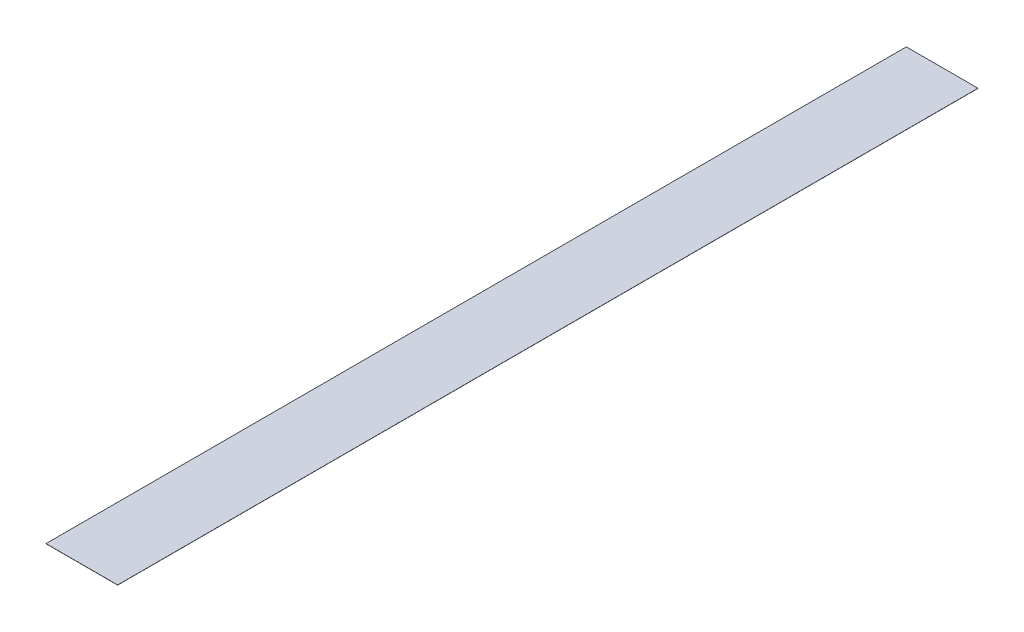
ISO-10303-21;
HEADER;
FILE_DESCRIPTION(('STEP AP214'),'2;1');
FILE_NAME('part.step','',(''),(''),'','','');
FILE_SCHEMA(('AUTOMOTIVE_DESIGN { 1 0 10303 214 1 1 1 1 }'));
ENDSEC;
DATA;
#1=APPLICATION_CONTEXT('core data for automotive mechanical design processes');
#2=APPLICATION_PROTOCOL_DEFINITION('international standard','automotive_design',2000,#1);
#3=PRODUCT_CONTEXT('',#1,'mechanical');
#4=PRODUCT('Part','Part','',(#3));
#5=PRODUCT_RELATED_PRODUCT_CATEGORY('part','',(#4));
#6=PRODUCT_DEFINITION_FORMATION('','',#4);
#7=PRODUCT_DEFINITION_CONTEXT('part definition',#1,'design');
#8=PRODUCT_DEFINITION('design','',#6,#7);
#9=PRODUCT_DEFINITION_SHAPE('','',#8);
#10=(LENGTH_UNIT() NAMED_UNIT(*) SI_UNIT(.MILLI.,.METRE.));
#11=(NAMED_UNIT(*) PLANE_ANGLE_UNIT() SI_UNIT($,.RADIAN.));
#12=(NAMED_UNIT(*) SI_UNIT($,.STERADIAN.) SOLID_ANGLE_UNIT());
#13=UNCERTAINTY_MEASURE_WITH_UNIT(LENGTH_MEASURE(1.E-05),#10,'distance_accuracy_value','');
#14=(GEOMETRIC_REPRESENTATION_CONTEXT(3) GLOBAL_UNCERTAINTY_ASSIGNED_CONTEXT((#13)) GLOBAL_UNIT_ASSIGNED_CONTEXT((#10,
#11,#12)) REPRESENTATION_CONTEXT('',''));
#15=CARTESIAN_POINT('',(0.,0.,0.));
#16=DIRECTION('',(0.,0.,1.));
#17=DIRECTION('',(1.,0.,0.));
#18=AXIS2_PLACEMENT_3D('',#15,#16,#17);
#19=CARTESIAN_POINT('',(-12.45,0.0508,-149.5));
#20=DIRECTION('',(1.,0.,0.));
#21=DIRECTION('',(0.,0.,-1.));
#22=AXIS2_PLACEMENT_3D('',#19,#20,#21);
#23=PLANE('',#22);
#24=DIRECTION('',(0.,0.,1.));
#25=VECTOR('',#24,1.);
#26=CARTESIAN_POINT('',(-12.45,0.,-149.5));
#27=LINE('',#26,#25);
#28=CARTESIAN_POINT('',(-12.45,0.,-149.5));
#29=VERTEX_POINT('',#28);
#30=CARTESIAN_POINT('',(-12.45,0.,149.5));
#31=VERTEX_POINT('',#30);
#32=EDGE_CURVE('E96',#29,#31,#27,.T.);
#33=ORIENTED_EDGE('',*,*,#32,.T.);
#34=DIRECTION('',(0.,-1.,0.));
#35=VECTOR('',#34,1.);
#36=CARTESIAN_POINT('',(-12.45,0.0508,149.5));
#37=LINE('',#36,#35);
#38=CARTESIAN_POINT('',(-12.45,0.0508,149.5));
#39=VERTEX_POINT('',#38);
#40=EDGE_CURVE('E11',#39,#31,#37,.T.);
#41=ORIENTED_EDGE('',*,*,#40,.F.);
#42=DIRECTION('',(0.,0.,1.));
#43=VECTOR('',#42,1.);
#44=CARTESIAN_POINT('',(-12.45,0.0508,-149.5));
#45=LINE('',#44,#43);
#46=CARTESIAN_POINT('',(-12.45,0.0508,-149.5));
#47=VERTEX_POINT('',#46);
#48=EDGE_CURVE('E84',#47,#39,#45,.T.);
#49=ORIENTED_EDGE('',*,*,#48,.F.);
#50=DIRECTION('',(0.,-1.,0.));
#51=VECTOR('',#50,1.);
#52=CARTESIAN_POINT('',(-12.45,0.0508,-149.5));
#53=LINE('',#52,#51);
#54=EDGE_CURVE('E92',#47,#29,#53,.T.);
#55=ORIENTED_EDGE('',*,*,#54,.T.);
#56=EDGE_LOOP('',(#33,#41,#49,#55));
#57=FACE_BOUND('',#56,.T.);
#58=ADVANCED_FACE('F33',(#57),#23,.F.);
#59=CARTESIAN_POINT('',(-12.45,0.0508,149.5));
#60=DIRECTION('',(0.,0.,-1.));
#61=DIRECTION('',(-1.,0.,0.));
#62=AXIS2_PLACEMENT_3D('',#59,#60,#61);
#63=PLANE('',#62);
#64=DIRECTION('',(1.,0.,0.));
#65=VECTOR('',#64,1.);
#66=CARTESIAN_POINT('',(-12.45,0.,149.5));
#67=LINE('',#66,#65);
#68=CARTESIAN_POINT('',(12.45,0.,149.5));
#69=VERTEX_POINT('',#68);
#70=EDGE_CURVE('E88',#31,#69,#67,.T.);
#71=ORIENTED_EDGE('',*,*,#70,.T.);
#72=DIRECTION('',(0.,-1.,0.));
#73=VECTOR('',#72,1.);
#74=CARTESIAN_POINT('',(12.45,0.0508,149.5));
#75=LINE('',#74,#73);
#76=CARTESIAN_POINT('',(12.45,0.0508,149.5));
#77=VERTEX_POINT('',#76);
#78=EDGE_CURVE('E41',#77,#69,#75,.T.);
#79=ORIENTED_EDGE('',*,*,#78,.F.);
#80=DIRECTION('',(1.,0.,0.));
#81=VECTOR('',#80,1.);
#82=CARTESIAN_POINT('',(-12.45,0.0508,149.5));
#83=LINE('',#82,#81);
#84=EDGE_CURVE('E79',#39,#77,#83,.T.);
#85=ORIENTED_EDGE('',*,*,#84,.F.);
#86=ORIENTED_EDGE('',*,*,#40,.T.);
#87=EDGE_LOOP('',(#71,#79,#85,#86));
#88=FACE_BOUND('',#87,.T.);
#89=ADVANCED_FACE('F87',(#88),#63,.F.);
#90=CARTESIAN_POINT('',(12.45,0.0508,-149.5));
#91=DIRECTION('',(-1.,0.,0.));
#92=DIRECTION('',(0.,0.,1.));
#93=AXIS2_PLACEMENT_3D('',#90,#91,#92);
#94=PLANE('',#93);
#95=DIRECTION('',(0.,0.,-1.));
#96=VECTOR('',#95,1.);
#97=CARTESIAN_POINT('',(12.45,0.,-149.5));
#98=LINE('',#97,#96);
#99=CARTESIAN_POINT('',(12.45,0.,-149.5));
#100=VERTEX_POINT('',#99);
#101=EDGE_CURVE('E66',#69,#100,#98,.T.);
#102=ORIENTED_EDGE('',*,*,#101,.T.);
#103=DIRECTION('',(0.,-1.,0.));
#104=VECTOR('',#103,1.);
#105=CARTESIAN_POINT('',(12.45,0.0508,-149.5));
#106=LINE('',#105,#104);
#107=CARTESIAN_POINT('',(12.45,0.0508,-149.5));
#108=VERTEX_POINT('',#107);
#109=EDGE_CURVE('E89',#108,#100,#106,.T.);
#110=ORIENTED_EDGE('',*,*,#109,.F.);
#111=DIRECTION('',(0.,0.,-1.));
#112=VECTOR('',#111,1.);
#113=CARTESIAN_POINT('',(12.45,0.0508,-149.5));
#114=LINE('',#113,#112);
#115=EDGE_CURVE('E82',#77,#108,#114,.T.);
#116=ORIENTED_EDGE('',*,*,#115,.F.);
#117=ORIENTED_EDGE('',*,*,#78,.T.);
#118=EDGE_LOOP('',(#102,#110,#116,#117));
#119=FACE_BOUND('',#118,.T.);
#120=ADVANCED_FACE('F90',(#119),#94,.F.);
#121=CARTESIAN_POINT('',(-12.45,0.0508,-149.5));
#122=DIRECTION('',(0.,0.,1.));
#123=DIRECTION('',(1.,0.,0.));
#124=AXIS2_PLACEMENT_3D('',#121,#122,#123);
#125=PLANE('',#124);
#126=DIRECTION('',(-1.,0.,0.));
#127=VECTOR('',#126,1.);
#128=CARTESIAN_POINT('',(-12.45,0.,-149.5));
#129=LINE('',#128,#127);
#130=EDGE_CURVE('E72',#100,#29,#129,.T.);
#131=ORIENTED_EDGE('',*,*,#130,.T.);
#132=ORIENTED_EDGE('',*,*,#54,.F.);
#133=DIRECTION('',(-1.,0.,0.));
#134=VECTOR('',#133,1.);
#135=CARTESIAN_POINT('',(-12.45,0.0508,-149.5));
#136=LINE('',#135,#134);
#137=EDGE_CURVE('E49',#108,#47,#136,.T.);
#138=ORIENTED_EDGE('',*,*,#137,.F.);
#139=ORIENTED_EDGE('',*,*,#109,.T.);
#140=EDGE_LOOP('',(#131,#132,#138,#139));
#141=FACE_BOUND('',#140,.T.);
#142=ADVANCED_FACE('F103',(#141),#125,.F.);
#143=CARTESIAN_POINT('',(-12.45,0.0508,149.5));
#144=DIRECTION('',(0.,1.,0.));
#145=DIRECTION('',(0.,0.,1.));
#146=AXIS2_PLACEMENT_3D('',#143,#144,#145);
#147=PLANE('',#146);
#148=ORIENTED_EDGE('',*,*,#48,.T.);
#149=ORIENTED_EDGE('',*,*,#84,.T.);
#150=ORIENTED_EDGE('',*,*,#115,.T.);
#151=ORIENTED_EDGE('',*,*,#137,.T.);
#152=EDGE_LOOP('',(#148,#149,#150,#151));
#153=FACE_BOUND('',#152,.T.);
#154=ADVANCED_FACE('F80',(#153),#147,.T.);
#155=CARTESIAN_POINT('',(-12.45,0.,149.5));
#156=DIRECTION('',(0.,1.,0.));
#157=DIRECTION('',(0.,0.,1.));
#158=AXIS2_PLACEMENT_3D('',#155,#156,#157);
#159=PLANE('',#158);
#160=ORIENTED_EDGE('',*,*,#32,.F.);
#161=ORIENTED_EDGE('',*,*,#130,.F.);
#162=ORIENTED_EDGE('',*,*,#101,.F.);
#163=ORIENTED_EDGE('',*,*,#70,.F.);
#164=EDGE_LOOP('',(#160,#161,#162,#163));
#165=FACE_BOUND('',#164,.T.);
#166=ADVANCED_FACE('F106',(#165),#159,.F.);
#167=CLOSED_SHELL('',(#58,#89,#120,#142,#154,#166));
#168=MANIFOLD_SOLID_BREP('B2',#167);
#169=ADVANCED_BREP_SHAPE_REPRESENTATION('',(#18,#168),#14);
#170=SHAPE_DEFINITION_REPRESENTATION(#9,#169);
ENDSEC;
END-ISO-10303-21;
